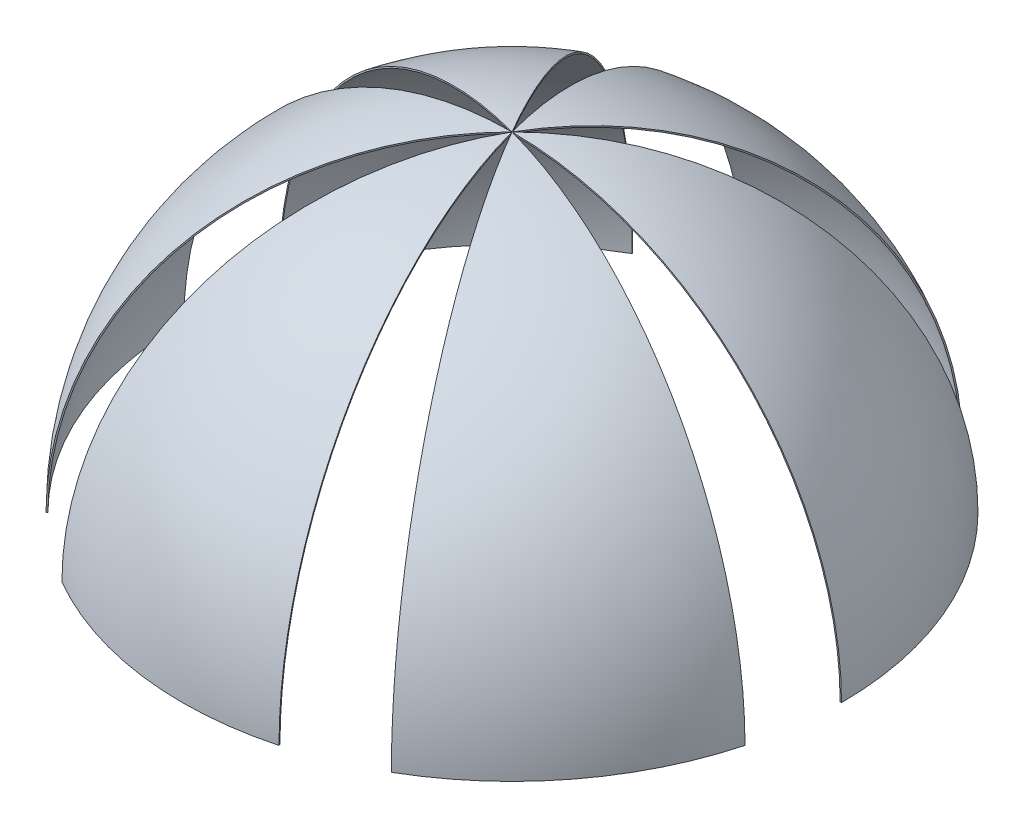
ISO-10303-21;
HEADER;
FILE_DESCRIPTION(('STEP AP214'),'2;1');
FILE_NAME('part.step','',(''),(''),'','','');
FILE_SCHEMA(('AUTOMOTIVE_DESIGN { 1 0 10303 214 1 1 1 1 }'));
ENDSEC;
DATA;
#1=APPLICATION_CONTEXT('core data for automotive mechanical design processes');
#2=APPLICATION_PROTOCOL_DEFINITION('international standard','automotive_design',2000,#1);
#3=PRODUCT_CONTEXT('',#1,'mechanical');
#4=PRODUCT('Part','Part','',(#3));
#5=PRODUCT_RELATED_PRODUCT_CATEGORY('part','',(#4));
#6=PRODUCT_DEFINITION_FORMATION('','',#4);
#7=PRODUCT_DEFINITION_CONTEXT('part definition',#1,'design');
#8=PRODUCT_DEFINITION('design','',#6,#7);
#9=PRODUCT_DEFINITION_SHAPE('','',#8);
#10=(LENGTH_UNIT() NAMED_UNIT(*) SI_UNIT(.MILLI.,.METRE.));
#11=(NAMED_UNIT(*) PLANE_ANGLE_UNIT() SI_UNIT($,.RADIAN.));
#12=(NAMED_UNIT(*) SI_UNIT($,.STERADIAN.) SOLID_ANGLE_UNIT());
#13=UNCERTAINTY_MEASURE_WITH_UNIT(LENGTH_MEASURE(1.E-05),#10,'distance_accuracy_value','');
#14=(GEOMETRIC_REPRESENTATION_CONTEXT(3) GLOBAL_UNCERTAINTY_ASSIGNED_CONTEXT((#13)) GLOBAL_UNIT_ASSIGNED_CONTEXT((#10,
#11,#12)) REPRESENTATION_CONTEXT('',''));
#15=CARTESIAN_POINT('',(0.,0.,0.));
#16=DIRECTION('',(0.,0.,1.));
#17=DIRECTION('',(1.,0.,0.));
#18=AXIS2_PLACEMENT_3D('',#15,#16,#17);
#19=CARTESIAN_POINT('',(0.,0.,0.));
#20=DIRECTION('',(0.,-1.,0.));
#21=DIRECTION('',(-0.258819045102511,0.,-0.965925826289071));
#22=AXIS2_PLACEMENT_3D('',#19,#20,#21);
#23=SPHERICAL_SURFACE('',#22,6140.45);
#24=CARTESIAN_POINT('',(0.,0.,0.));
#25=DIRECTION('',(-0.866025403784433,0.,-0.50000000000001));
#26=DIRECTION('',(-0.50000000000001,0.,0.866025403784433));
#27=AXIS2_PLACEMENT_3D('',#24,#25,#26);
#28=CIRCLE('',#27,6140.45);
#29=CARTESIAN_POINT('',(0.,6140.45,0.));
#30=VERTEX_POINT('',#29);
#31=CARTESIAN_POINT('',(3070.22500000006,0.,-5317.78569066812));
#32=VERTEX_POINT('',#31);
#33=EDGE_CURVE('E58',#30,#32,#28,.T.);
#34=ORIENTED_EDGE('',*,*,#33,.F.);
#35=CARTESIAN_POINT('',(0.,0.,0.));
#36=DIRECTION('',(-0.965925826289071,0.,0.258819045102511));
#37=DIRECTION('',(0.258819045102511,0.,0.965925826289071));
#38=AXIS2_PLACEMENT_3D('',#35,#36,#37);
#39=CIRCLE('',#38,6140.45);
#40=CARTESIAN_POINT('',(-1589.26540549971,0.,-5931.21924003672));
#41=VERTEX_POINT('',#40);
#42=EDGE_CURVE('E78',#30,#41,#39,.T.);
#43=ORIENTED_EDGE('',*,*,#42,.T.);
#44=CARTESIAN_POINT('',(0.,0.,0.));
#45=DIRECTION('',(0.,-1.,0.));
#46=DIRECTION('',(-0.866025403784433,0.,-0.50000000000001));
#47=AXIS2_PLACEMENT_3D('',#44,#45,#46);
#48=CIRCLE('',#47,6140.45);
#49=EDGE_CURVE('E51',#41,#32,#48,.T.);
#50=ORIENTED_EDGE('',*,*,#49,.T.);
#51=EDGE_LOOP('',(#34,#43,#50));
#52=FACE_BOUND('',#51,.T.);
#53=ADVANCED_FACE('F43',(#52),#23,.F.);
#54=CARTESIAN_POINT('',(0.,0.,0.));
#55=DIRECTION('',(0.,-1.,0.));
#56=DIRECTION('',(-0.258819045102511,0.,-0.965925826289071));
#57=AXIS2_PLACEMENT_3D('',#54,#55,#56);
#58=SPHERICAL_SURFACE('',#57,6165.85);
#59=CARTESIAN_POINT('',(0.,0.,0.));
#60=DIRECTION('',(0.,-1.,0.));
#61=DIRECTION('',(-0.866025403784433,0.,-0.50000000000001));
#62=AXIS2_PLACEMENT_3D('',#59,#60,#61);
#63=CIRCLE('',#62,6165.85);
#64=CARTESIAN_POINT('',(-1595.83940924532,0.,-5955.75375602447));
#65=VERTEX_POINT('',#64);
#66=CARTESIAN_POINT('',(3082.92500000006,0.,-5339.78273592424));
#67=VERTEX_POINT('',#66);
#68=EDGE_CURVE('E12',#65,#67,#63,.T.);
#69=ORIENTED_EDGE('',*,*,#68,.F.);
#70=CARTESIAN_POINT('',(0.,0.,0.));
#71=DIRECTION('',(0.965925826289071,0.,-0.258819045102511));
#72=DIRECTION('',(-0.258819045102511,0.,-0.965925826289071));
#73=AXIS2_PLACEMENT_3D('',#70,#71,#72);
#74=CIRCLE('',#73,6165.85);
#75=CARTESIAN_POINT('',(0.,6165.85,0.));
#76=VERTEX_POINT('',#75);
#77=EDGE_CURVE('E94',#65,#76,#74,.T.);
#78=ORIENTED_EDGE('',*,*,#77,.T.);
#79=CARTESIAN_POINT('',(0.,0.,0.));
#80=DIRECTION('',(0.866025403784433,0.,0.50000000000001));
#81=DIRECTION('',(0.50000000000001,0.,-0.866025403784433));
#82=AXIS2_PLACEMENT_3D('',#79,#80,#81);
#83=CIRCLE('',#82,6165.85);
#84=EDGE_CURVE('E65',#67,#76,#83,.T.);
#85=ORIENTED_EDGE('',*,*,#84,.F.);
#86=EDGE_LOOP('',(#69,#78,#85));
#87=FACE_BOUND('',#86,.T.);
#88=ADVANCED_FACE('F45',(#87),#58,.T.);
#89=CARTESIAN_POINT('',(-1589.26540549971,0.,-5931.21924003672));
#90=DIRECTION('',(0.,-1.,0.));
#91=DIRECTION('',(-0.866025403784433,0.,-0.50000000000001));
#92=AXIS2_PLACEMENT_3D('',#89,#90,#91);
#93=PLANE('',#92);
#94=DIRECTION('',(-0.258819045102511,0.,-0.965925826289071));
#95=VECTOR('',#94,1.);
#96=CARTESIAN_POINT('',(-1589.26540549971,0.,-5931.21924003672));
#97=LINE('',#96,#95);
#98=EDGE_CURVE('E92',#41,#65,#97,.T.);
#99=ORIENTED_EDGE('',*,*,#98,.T.);
#100=ORIENTED_EDGE('',*,*,#68,.T.);
#101=DIRECTION('',(0.50000000000001,0.,-0.866025403784433));
#102=VECTOR('',#101,1.);
#103=CARTESIAN_POINT('',(3070.22500000006,0.,-5317.78569066812));
#104=LINE('',#103,#102);
#105=EDGE_CURVE('E83',#32,#67,#104,.T.);
#106=ORIENTED_EDGE('',*,*,#105,.F.);
#107=ORIENTED_EDGE('',*,*,#49,.F.);
#108=EDGE_LOOP('',(#99,#100,#106,#107));
#109=FACE_BOUND('',#108,.T.);
#110=ADVANCED_FACE('F84',(#109),#93,.T.);
#111=CARTESIAN_POINT('',(0.,0.,0.));
#112=DIRECTION('',(-0.965925826289071,0.,0.258819045102511));
#113=DIRECTION('',(0.258819045102511,0.,0.965925826289071));
#114=AXIS2_PLACEMENT_3D('',#111,#112,#113);
#115=PLANE('',#114);
#116=ORIENTED_EDGE('',*,*,#42,.F.);
#117=DIRECTION('',(0.,-1.,0.));
#118=VECTOR('',#117,1.);
#119=CARTESIAN_POINT('',(0.,6140.45,0.));
#120=LINE('',#119,#118);
#121=EDGE_CURVE('E82',#76,#30,#120,.T.);
#122=ORIENTED_EDGE('',*,*,#121,.F.);
#123=ORIENTED_EDGE('',*,*,#77,.F.);
#124=ORIENTED_EDGE('',*,*,#98,.F.);
#125=EDGE_LOOP('',(#116,#122,#123,#124));
#126=FACE_BOUND('',#125,.T.);
#127=ADVANCED_FACE('F99',(#126),#115,.T.);
#128=CARTESIAN_POINT('',(0.,0.,0.));
#129=DIRECTION('',(-0.866025403784433,0.,-0.50000000000001));
#130=DIRECTION('',(-0.50000000000001,0.,0.866025403784433));
#131=AXIS2_PLACEMENT_3D('',#128,#129,#130);
#132=PLANE('',#131);
#133=ORIENTED_EDGE('',*,*,#33,.T.);
#134=ORIENTED_EDGE('',*,*,#105,.T.);
#135=ORIENTED_EDGE('',*,*,#84,.T.);
#136=ORIENTED_EDGE('',*,*,#121,.T.);
#137=EDGE_LOOP('',(#133,#134,#135,#136));
#138=FACE_BOUND('',#137,.T.);
#139=ADVANCED_FACE('F86',(#138),#132,.F.);
#140=CLOSED_SHELL('',(#53,#88,#110,#127,#139));
#141=MANIFOLD_SOLID_BREP('B2',#140);
#142=CARTESIAN_POINT('',(0.,0.,0.));
#143=DIRECTION('',(0.,-1.,0.));
#144=DIRECTION('',(-0.965925826289066,0.,-0.258819045102528));
#145=AXIS2_PLACEMENT_3D('',#142,#143,#144);
#146=SPHERICAL_SURFACE('',#145,6140.45);
#147=CARTESIAN_POINT('',(0.,0.,0.));
#148=DIRECTION('',(-0.866025403784443,0.,0.499999999999992));
#149=DIRECTION('',(0.499999999999992,0.,0.866025403784443));
#150=AXIS2_PLACEMENT_3D('',#147,#148,#149);
#151=CIRCLE('',#150,6140.45);
#152=CARTESIAN_POINT('',(0.,6140.45,0.));
#153=VERTEX_POINT('',#152);
#154=CARTESIAN_POINT('',(-3070.22499999995,0.,-5317.78569066818));
#155=VERTEX_POINT('',#154);
#156=EDGE_CURVE('E165',#153,#155,#151,.T.);
#157=ORIENTED_EDGE('',*,*,#156,.F.);
#158=CARTESIAN_POINT('',(0.,0.,0.));
#159=DIRECTION('',(-0.258819045102528,0.,0.965925826289066));
#160=DIRECTION('',(0.965925826289066,0.,0.258819045102528));
#161=AXIS2_PLACEMENT_3D('',#158,#159,#160);
#162=CIRCLE('',#161,6140.45);
#163=CARTESIAN_POINT('',(-5931.2192400367,0.,-1589.26540549982));
#164=VERTEX_POINT('',#163);
#165=EDGE_CURVE('E185',#153,#164,#162,.T.);
#166=ORIENTED_EDGE('',*,*,#165,.T.);
#167=CARTESIAN_POINT('',(0.,0.,0.));
#168=DIRECTION('',(0.,-1.,0.));
#169=DIRECTION('',(-0.866025403784443,0.,0.499999999999992));
#170=AXIS2_PLACEMENT_3D('',#167,#168,#169);
#171=CIRCLE('',#170,6140.45);
#172=EDGE_CURVE('E158',#164,#155,#171,.T.);
#173=ORIENTED_EDGE('',*,*,#172,.T.);
#174=EDGE_LOOP('',(#157,#166,#173));
#175=FACE_BOUND('',#174,.T.);
#176=ADVANCED_FACE('F150',(#175),#146,.F.);
#177=CARTESIAN_POINT('',(0.,0.,0.));
#178=DIRECTION('',(0.,-1.,0.));
#179=DIRECTION('',(-0.965925826289066,0.,-0.258819045102528));
#180=AXIS2_PLACEMENT_3D('',#177,#178,#179);
#181=SPHERICAL_SURFACE('',#180,6165.85);
#182=CARTESIAN_POINT('',(0.,0.,0.));
#183=DIRECTION('',(0.,-1.,0.));
#184=DIRECTION('',(-0.866025403784443,0.,0.499999999999992));
#185=AXIS2_PLACEMENT_3D('',#182,#183,#184);
#186=CIRCLE('',#185,6165.85);
#187=CARTESIAN_POINT('',(-5955.75375602444,0.,-1595.83940924542));
#188=VERTEX_POINT('',#187);
#189=CARTESIAN_POINT('',(-3082.92499999995,0.,-5339.78273592431));
#190=VERTEX_POINT('',#189);
#191=EDGE_CURVE('E41',#188,#190,#186,.T.);
#192=ORIENTED_EDGE('',*,*,#191,.F.);
#193=CARTESIAN_POINT('',(0.,0.,0.));
#194=DIRECTION('',(0.258819045102528,0.,-0.965925826289066));
#195=DIRECTION('',(-0.965925826289066,0.,-0.258819045102528));
#196=AXIS2_PLACEMENT_3D('',#193,#194,#195);
#197=CIRCLE('',#196,6165.85);
#198=CARTESIAN_POINT('',(0.,6165.85,0.));
#199=VERTEX_POINT('',#198);
#200=EDGE_CURVE('E201',#188,#199,#197,.T.);
#201=ORIENTED_EDGE('',*,*,#200,.T.);
#202=CARTESIAN_POINT('',(0.,0.,0.));
#203=DIRECTION('',(0.866025403784443,0.,-0.499999999999992));
#204=DIRECTION('',(-0.499999999999992,0.,-0.866025403784443));
#205=AXIS2_PLACEMENT_3D('',#202,#203,#204);
#206=CIRCLE('',#205,6165.85);
#207=EDGE_CURVE('E172',#190,#199,#206,.T.);
#208=ORIENTED_EDGE('',*,*,#207,.F.);
#209=EDGE_LOOP('',(#192,#201,#208));
#210=FACE_BOUND('',#209,.T.);
#211=ADVANCED_FACE('F152',(#210),#181,.T.);
#212=CARTESIAN_POINT('',(-5931.2192400367,0.,-1589.26540549982));
#213=DIRECTION('',(0.,-1.,0.));
#214=DIRECTION('',(-0.866025403784443,0.,0.499999999999992));
#215=AXIS2_PLACEMENT_3D('',#212,#213,#214);
#216=PLANE('',#215);
#217=DIRECTION('',(-0.965925826289066,0.,-0.258819045102528));
#218=VECTOR('',#217,1.);
#219=CARTESIAN_POINT('',(-5931.2192400367,0.,-1589.26540549982));
#220=LINE('',#219,#218);
#221=EDGE_CURVE('E199',#164,#188,#220,.T.);
#222=ORIENTED_EDGE('',*,*,#221,.T.);
#223=ORIENTED_EDGE('',*,*,#191,.T.);
#224=DIRECTION('',(-0.499999999999992,0.,-0.866025403784443));
#225=VECTOR('',#224,1.);
#226=CARTESIAN_POINT('',(-3070.22499999995,0.,-5317.78569066818));
#227=LINE('',#226,#225);
#228=EDGE_CURVE('E190',#155,#190,#227,.T.);
#229=ORIENTED_EDGE('',*,*,#228,.F.);
#230=ORIENTED_EDGE('',*,*,#172,.F.);
#231=EDGE_LOOP('',(#222,#223,#229,#230));
#232=FACE_BOUND('',#231,.T.);
#233=ADVANCED_FACE('F191',(#232),#216,.T.);
#234=CARTESIAN_POINT('',(0.,0.,0.));
#235=DIRECTION('',(-0.258819045102528,0.,0.965925826289066));
#236=DIRECTION('',(0.965925826289066,0.,0.258819045102528));
#237=AXIS2_PLACEMENT_3D('',#234,#235,#236);
#238=PLANE('',#237);
#239=ORIENTED_EDGE('',*,*,#165,.F.);
#240=DIRECTION('',(0.,-1.,0.));
#241=VECTOR('',#240,1.);
#242=CARTESIAN_POINT('',(0.,6140.45,0.));
#243=LINE('',#242,#241);
#244=EDGE_CURVE('E189',#199,#153,#243,.T.);
#245=ORIENTED_EDGE('',*,*,#244,.F.);
#246=ORIENTED_EDGE('',*,*,#200,.F.);
#247=ORIENTED_EDGE('',*,*,#221,.F.);
#248=EDGE_LOOP('',(#239,#245,#246,#247));
#249=FACE_BOUND('',#248,.T.);
#250=ADVANCED_FACE('F206',(#249),#238,.T.);
#251=CARTESIAN_POINT('',(0.,0.,0.));
#252=DIRECTION('',(-0.866025403784443,0.,0.499999999999992));
#253=DIRECTION('',(0.499999999999992,0.,0.866025403784443));
#254=AXIS2_PLACEMENT_3D('',#251,#252,#253);
#255=PLANE('',#254);
#256=ORIENTED_EDGE('',*,*,#156,.T.);
#257=ORIENTED_EDGE('',*,*,#228,.T.);
#258=ORIENTED_EDGE('',*,*,#207,.T.);
#259=ORIENTED_EDGE('',*,*,#244,.T.);
#260=EDGE_LOOP('',(#256,#257,#258,#259));
#261=FACE_BOUND('',#260,.T.);
#262=ADVANCED_FACE('F193',(#261),#255,.F.);
#263=CLOSED_SHELL('',(#176,#211,#233,#250,#262));
#264=MANIFOLD_SOLID_BREP('B6',#263);
#265=CARTESIAN_POINT('',(0.,0.,0.));
#266=DIRECTION('',(0.,-1.,0.));
#267=DIRECTION('',(-0.707106781186546,0.,0.707106781186549));
#268=AXIS2_PLACEMENT_3D('',#265,#266,#267);
#269=SPHERICAL_SURFACE('',#268,6140.45);
#270=CARTESIAN_POINT('',(0.,0.,0.));
#271=DIRECTION('',(0.,0.,1.));
#272=DIRECTION('',(1.,0.,0.));
#273=AXIS2_PLACEMENT_3D('',#270,#271,#272);
#274=CIRCLE('',#273,6140.45);
#275=CARTESIAN_POINT('',(0.,6140.45,0.));
#276=VERTEX_POINT('',#275);
#277=CARTESIAN_POINT('',(-6140.45,0.,0.));
#278=VERTEX_POINT('',#277);
#279=EDGE_CURVE('E272',#276,#278,#274,.T.);
#280=ORIENTED_EDGE('',*,*,#279,.F.);
#281=CARTESIAN_POINT('',(0.,0.,0.));
#282=DIRECTION('',(0.707106781186549,0.,0.707106781186546));
#283=DIRECTION('',(0.707106781186546,0.,-0.707106781186549));
#284=AXIS2_PLACEMENT_3D('',#281,#282,#283);
#285=CIRCLE('',#284,6140.45);
#286=CARTESIAN_POINT('',(-4341.95383453693,0.,4341.95383453694));
#287=VERTEX_POINT('',#286);
#288=EDGE_CURVE('E292',#276,#287,#285,.T.);
#289=ORIENTED_EDGE('',*,*,#288,.T.);
#290=CARTESIAN_POINT('',(0.,0.,0.));
#291=DIRECTION('',(0.,-1.,0.));
#292=DIRECTION('',(0.,0.,1.));
#293=AXIS2_PLACEMENT_3D('',#290,#291,#292);
#294=CIRCLE('',#293,6140.45);
#295=EDGE_CURVE('E265',#287,#278,#294,.T.);
#296=ORIENTED_EDGE('',*,*,#295,.T.);
#297=EDGE_LOOP('',(#280,#289,#296));
#298=FACE_BOUND('',#297,.T.);
#299=ADVANCED_FACE('F257',(#298),#269,.F.);
#300=CARTESIAN_POINT('',(0.,0.,0.));
#301=DIRECTION('',(0.,-1.,0.));
#302=DIRECTION('',(-0.707106781186546,0.,0.707106781186549));
#303=AXIS2_PLACEMENT_3D('',#300,#301,#302);
#304=SPHERICAL_SURFACE('',#303,6165.85);
#305=CARTESIAN_POINT('',(0.,0.,0.));
#306=DIRECTION('',(0.,-1.,0.));
#307=DIRECTION('',(0.,0.,1.));
#308=AXIS2_PLACEMENT_3D('',#305,#306,#307);
#309=CIRCLE('',#308,6165.85);
#310=CARTESIAN_POINT('',(-4359.91434677907,0.,4359.91434677908));
#311=VERTEX_POINT('',#310);
#312=CARTESIAN_POINT('',(-6165.85,0.,0.));
#313=VERTEX_POINT('',#312);
#314=EDGE_CURVE('E148',#311,#313,#309,.T.);
#315=ORIENTED_EDGE('',*,*,#314,.F.);
#316=CARTESIAN_POINT('',(0.,0.,0.));
#317=DIRECTION('',(-0.707106781186549,0.,-0.707106781186546));
#318=DIRECTION('',(-0.707106781186546,0.,0.707106781186549));
#319=AXIS2_PLACEMENT_3D('',#316,#317,#318);
#320=CIRCLE('',#319,6165.85);
#321=CARTESIAN_POINT('',(0.,6165.85,0.));
#322=VERTEX_POINT('',#321);
#323=EDGE_CURVE('E308',#311,#322,#320,.T.);
#324=ORIENTED_EDGE('',*,*,#323,.T.);
#325=CARTESIAN_POINT('',(0.,0.,0.));
#326=DIRECTION('',(0.,0.,-1.));
#327=DIRECTION('',(-1.,0.,0.));
#328=AXIS2_PLACEMENT_3D('',#325,#326,#327);
#329=CIRCLE('',#328,6165.85);
#330=EDGE_CURVE('E279',#313,#322,#329,.T.);
#331=ORIENTED_EDGE('',*,*,#330,.F.);
#332=EDGE_LOOP('',(#315,#324,#331));
#333=FACE_BOUND('',#332,.T.);
#334=ADVANCED_FACE('F259',(#333),#304,.T.);
#335=CARTESIAN_POINT('',(-4341.95383453693,0.,4341.95383453694));
#336=DIRECTION('',(0.,-1.,0.));
#337=DIRECTION('',(0.,0.,1.));
#338=AXIS2_PLACEMENT_3D('',#335,#336,#337);
#339=PLANE('',#338);
#340=DIRECTION('',(-0.707106781186546,0.,0.707106781186549));
#341=VECTOR('',#340,1.);
#342=CARTESIAN_POINT('',(-4341.95383453693,0.,4341.95383453694));
#343=LINE('',#342,#341);
#344=EDGE_CURVE('E306',#287,#311,#343,.T.);
#345=ORIENTED_EDGE('',*,*,#344,.T.);
#346=ORIENTED_EDGE('',*,*,#314,.T.);
#347=DIRECTION('',(-1.,0.,0.));
#348=VECTOR('',#347,1.);
#349=CARTESIAN_POINT('',(-6140.45,0.,0.));
#350=LINE('',#349,#348);
#351=EDGE_CURVE('E297',#278,#313,#350,.T.);
#352=ORIENTED_EDGE('',*,*,#351,.F.);
#353=ORIENTED_EDGE('',*,*,#295,.F.);
#354=EDGE_LOOP('',(#345,#346,#352,#353));
#355=FACE_BOUND('',#354,.T.);
#356=ADVANCED_FACE('F298',(#355),#339,.T.);
#357=CARTESIAN_POINT('',(0.,0.,0.));
#358=DIRECTION('',(0.707106781186549,0.,0.707106781186546));
#359=DIRECTION('',(0.707106781186546,0.,-0.707106781186549));
#360=AXIS2_PLACEMENT_3D('',#357,#358,#359);
#361=PLANE('',#360);
#362=ORIENTED_EDGE('',*,*,#288,.F.);
#363=DIRECTION('',(0.,-1.,0.));
#364=VECTOR('',#363,1.);
#365=CARTESIAN_POINT('',(0.,6140.45,0.));
#366=LINE('',#365,#364);
#367=EDGE_CURVE('E296',#322,#276,#366,.T.);
#368=ORIENTED_EDGE('',*,*,#367,.F.);
#369=ORIENTED_EDGE('',*,*,#323,.F.);
#370=ORIENTED_EDGE('',*,*,#344,.F.);
#371=EDGE_LOOP('',(#362,#368,#369,#370));
#372=FACE_BOUND('',#371,.T.);
#373=ADVANCED_FACE('F313',(#372),#361,.T.);
#374=CARTESIAN_POINT('',(0.,0.,0.));
#375=DIRECTION('',(0.,0.,1.));
#376=DIRECTION('',(1.,0.,0.));
#377=AXIS2_PLACEMENT_3D('',#374,#375,#376);
#378=PLANE('',#377);
#379=ORIENTED_EDGE('',*,*,#279,.T.);
#380=ORIENTED_EDGE('',*,*,#351,.T.);
#381=ORIENTED_EDGE('',*,*,#330,.T.);
#382=ORIENTED_EDGE('',*,*,#367,.T.);
#383=EDGE_LOOP('',(#379,#380,#381,#382));
#384=FACE_BOUND('',#383,.T.);
#385=ADVANCED_FACE('F300',(#384),#378,.F.);
#386=CLOSED_SHELL('',(#299,#334,#356,#373,#385));
#387=MANIFOLD_SOLID_BREP('B35',#386);
#388=CARTESIAN_POINT('',(0.,0.,0.));
#389=DIRECTION('',(0.,-1.,0.));
#390=DIRECTION('',(0.258819045102518,0.,0.965925826289069));
#391=AXIS2_PLACEMENT_3D('',#388,#389,#390);
#392=SPHERICAL_SURFACE('',#391,6140.45);
#393=CARTESIAN_POINT('',(0.,0.,0.));
#394=DIRECTION('',(0.866025403784436,0.,0.500000000000004));
#395=DIRECTION('',(0.500000000000004,0.,-0.866025403784436));
#396=AXIS2_PLACEMENT_3D('',#393,#394,#395);
#397=CIRCLE('',#396,6140.45);
#398=CARTESIAN_POINT('',(0.,6140.45,0.));
#399=VERTEX_POINT('',#398);
#400=CARTESIAN_POINT('',(-3070.22500000002,0.,5317.78569066814));
#401=VERTEX_POINT('',#400);
#402=EDGE_CURVE('E379',#399,#401,#397,.T.);
#403=ORIENTED_EDGE('',*,*,#402,.F.);
#404=CARTESIAN_POINT('',(0.,0.,0.));
#405=DIRECTION('',(0.965925826289069,0.,-0.258819045102518));
#406=DIRECTION('',(-0.258819045102518,0.,-0.965925826289069));
#407=AXIS2_PLACEMENT_3D('',#404,#405,#406);
#408=CIRCLE('',#407,6140.45);
#409=CARTESIAN_POINT('',(1589.26540549976,0.,5931.21924003671));
#410=VERTEX_POINT('',#409);
#411=EDGE_CURVE('E399',#399,#410,#408,.T.);
#412=ORIENTED_EDGE('',*,*,#411,.T.);
#413=CARTESIAN_POINT('',(0.,0.,0.));
#414=DIRECTION('',(0.,-1.,0.));
#415=DIRECTION('',(0.866025403784436,0.,0.500000000000004));
#416=AXIS2_PLACEMENT_3D('',#413,#414,#415);
#417=CIRCLE('',#416,6140.45);
#418=EDGE_CURVE('E372',#410,#401,#417,.T.);
#419=ORIENTED_EDGE('',*,*,#418,.T.);
#420=EDGE_LOOP('',(#403,#412,#419));
#421=FACE_BOUND('',#420,.T.);
#422=ADVANCED_FACE('F364',(#421),#392,.F.);
#423=CARTESIAN_POINT('',(0.,0.,0.));
#424=DIRECTION('',(0.,-1.,0.));
#425=DIRECTION('',(0.258819045102518,0.,0.965925826289069));
#426=AXIS2_PLACEMENT_3D('',#423,#424,#425);
#427=SPHERICAL_SURFACE('',#426,6165.85);
#428=CARTESIAN_POINT('',(0.,0.,0.));
#429=DIRECTION('',(0.,-1.,0.));
#430=DIRECTION('',(0.866025403784436,0.,0.500000000000004));
#431=AXIS2_PLACEMENT_3D('',#428,#429,#430);
#432=CIRCLE('',#431,6165.85);
#433=CARTESIAN_POINT('',(1595.83940924536,0.,5955.75375602446));
#434=VERTEX_POINT('',#433);
#435=CARTESIAN_POINT('',(-3082.92500000002,0.,5339.78273592427));
#436=VERTEX_POINT('',#435);
#437=EDGE_CURVE('E255',#434,#436,#432,.T.);
#438=ORIENTED_EDGE('',*,*,#437,.F.);
#439=CARTESIAN_POINT('',(0.,0.,0.));
#440=DIRECTION('',(-0.965925826289069,0.,0.258819045102518));
#441=DIRECTION('',(0.258819045102518,0.,0.965925826289069));
#442=AXIS2_PLACEMENT_3D('',#439,#440,#441);
#443=CIRCLE('',#442,6165.85);
#444=CARTESIAN_POINT('',(0.,6165.85,0.));
#445=VERTEX_POINT('',#444);
#446=EDGE_CURVE('E415',#434,#445,#443,.T.);
#447=ORIENTED_EDGE('',*,*,#446,.T.);
#448=CARTESIAN_POINT('',(0.,0.,0.));
#449=DIRECTION('',(-0.866025403784436,0.,-0.500000000000004));
#450=DIRECTION('',(-0.500000000000004,0.,0.866025403784436));
#451=AXIS2_PLACEMENT_3D('',#448,#449,#450);
#452=CIRCLE('',#451,6165.85);
#453=EDGE_CURVE('E386',#436,#445,#452,.T.);
#454=ORIENTED_EDGE('',*,*,#453,.F.);
#455=EDGE_LOOP('',(#438,#447,#454));
#456=FACE_BOUND('',#455,.T.);
#457=ADVANCED_FACE('F366',(#456),#427,.T.);
#458=CARTESIAN_POINT('',(1589.26540549976,0.,5931.21924003671));
#459=DIRECTION('',(0.,-1.,0.));
#460=DIRECTION('',(0.866025403784436,0.,0.500000000000004));
#461=AXIS2_PLACEMENT_3D('',#458,#459,#460);
#462=PLANE('',#461);
#463=DIRECTION('',(0.258819045102518,0.,0.965925826289069));
#464=VECTOR('',#463,1.);
#465=CARTESIAN_POINT('',(1589.26540549976,0.,5931.21924003671));
#466=LINE('',#465,#464);
#467=EDGE_CURVE('E413',#410,#434,#466,.T.);
#468=ORIENTED_EDGE('',*,*,#467,.T.);
#469=ORIENTED_EDGE('',*,*,#437,.T.);
#470=DIRECTION('',(-0.500000000000004,0.,0.866025403784436));
#471=VECTOR('',#470,1.);
#472=CARTESIAN_POINT('',(-3070.22500000002,0.,5317.78569066814));
#473=LINE('',#472,#471);
#474=EDGE_CURVE('E404',#401,#436,#473,.T.);
#475=ORIENTED_EDGE('',*,*,#474,.F.);
#476=ORIENTED_EDGE('',*,*,#418,.F.);
#477=EDGE_LOOP('',(#468,#469,#475,#476));
#478=FACE_BOUND('',#477,.T.);
#479=ADVANCED_FACE('F405',(#478),#462,.T.);
#480=CARTESIAN_POINT('',(0.,0.,0.));
#481=DIRECTION('',(0.965925826289069,0.,-0.258819045102518));
#482=DIRECTION('',(-0.258819045102518,0.,-0.965925826289069));
#483=AXIS2_PLACEMENT_3D('',#480,#481,#482);
#484=PLANE('',#483);
#485=ORIENTED_EDGE('',*,*,#411,.F.);
#486=DIRECTION('',(0.,-1.,0.));
#487=VECTOR('',#486,1.);
#488=CARTESIAN_POINT('',(0.,6140.45,0.));
#489=LINE('',#488,#487);
#490=EDGE_CURVE('E403',#445,#399,#489,.T.);
#491=ORIENTED_EDGE('',*,*,#490,.F.);
#492=ORIENTED_EDGE('',*,*,#446,.F.);
#493=ORIENTED_EDGE('',*,*,#467,.F.);
#494=EDGE_LOOP('',(#485,#491,#492,#493));
#495=FACE_BOUND('',#494,.T.);
#496=ADVANCED_FACE('F420',(#495),#484,.T.);
#497=CARTESIAN_POINT('',(0.,0.,0.));
#498=DIRECTION('',(0.866025403784436,0.,0.500000000000004));
#499=DIRECTION('',(0.500000000000004,0.,-0.866025403784436));
#500=AXIS2_PLACEMENT_3D('',#497,#498,#499);
#501=PLANE('',#500);
#502=ORIENTED_EDGE('',*,*,#402,.T.);
#503=ORIENTED_EDGE('',*,*,#474,.T.);
#504=ORIENTED_EDGE('',*,*,#453,.T.);
#505=ORIENTED_EDGE('',*,*,#490,.T.);
#506=EDGE_LOOP('',(#502,#503,#504,#505));
#507=FACE_BOUND('',#506,.T.);
#508=ADVANCED_FACE('F407',(#507),#501,.F.);
#509=CLOSED_SHELL('',(#422,#457,#479,#496,#508));
#510=MANIFOLD_SOLID_BREP('B142',#509);
#511=CARTESIAN_POINT('',(0.,0.,0.));
#512=DIRECTION('',(0.,-1.,0.));
#513=DIRECTION('',(0.965925826289068,0.,0.258819045102521));
#514=AXIS2_PLACEMENT_3D('',#511,#512,#513);
#515=SPHERICAL_SURFACE('',#514,6140.45);
#516=CARTESIAN_POINT('',(0.,0.,0.));
#517=DIRECTION('',(0.86602540378444,0.,-0.499999999999998));
#518=DIRECTION('',(-0.499999999999998,0.,-0.86602540378444));
#519=AXIS2_PLACEMENT_3D('',#516,#517,#518);
#520=CIRCLE('',#519,6140.45);
#521=CARTESIAN_POINT('',(0.,6140.45,0.));
#522=VERTEX_POINT('',#521);
#523=CARTESIAN_POINT('',(3070.22499999999,0.,5317.78569066816));
#524=VERTEX_POINT('',#523);
#525=EDGE_CURVE('E485',#522,#524,#520,.T.);
#526=ORIENTED_EDGE('',*,*,#525,.F.);
#527=CARTESIAN_POINT('',(0.,0.,0.));
#528=DIRECTION('',(0.258819045102521,0.,-0.965925826289068));
#529=DIRECTION('',(-0.965925826289068,0.,-0.258819045102521));
#530=AXIS2_PLACEMENT_3D('',#527,#528,#529);
#531=CIRCLE('',#530,6140.45);
#532=CARTESIAN_POINT('',(5931.21924003671,0.,1589.26540549978));
#533=VERTEX_POINT('',#532);
#534=EDGE_CURVE('E505',#522,#533,#531,.T.);
#535=ORIENTED_EDGE('',*,*,#534,.T.);
#536=CARTESIAN_POINT('',(0.,0.,0.));
#537=DIRECTION('',(0.,-1.,0.));
#538=DIRECTION('',(0.86602540378444,0.,-0.499999999999998));
#539=AXIS2_PLACEMENT_3D('',#536,#537,#538);
#540=CIRCLE('',#539,6140.45);
#541=EDGE_CURVE('E478',#533,#524,#540,.T.);
#542=ORIENTED_EDGE('',*,*,#541,.T.);
#543=EDGE_LOOP('',(#526,#535,#542));
#544=FACE_BOUND('',#543,.T.);
#545=ADVANCED_FACE('F470',(#544),#515,.F.);
#546=CARTESIAN_POINT('',(0.,0.,0.));
#547=DIRECTION('',(0.,-1.,0.));
#548=DIRECTION('',(0.965925826289068,0.,0.258819045102521));
#549=AXIS2_PLACEMENT_3D('',#546,#547,#548);
#550=SPHERICAL_SURFACE('',#549,6165.85);
#551=CARTESIAN_POINT('',(0.,0.,0.));
#552=DIRECTION('',(0.,-1.,0.));
#553=DIRECTION('',(0.86602540378444,0.,-0.499999999999998));
#554=AXIS2_PLACEMENT_3D('',#551,#552,#553);
#555=CIRCLE('',#554,6165.85);
#556=CARTESIAN_POINT('',(5955.75375602445,0.,1595.83940924538));
#557=VERTEX_POINT('',#556);
#558=CARTESIAN_POINT('',(3082.92499999999,0.,5339.78273592429));
#559=VERTEX_POINT('',#558);
#560=EDGE_CURVE('E362',#557,#559,#555,.T.);
#561=ORIENTED_EDGE('',*,*,#560,.F.);
#562=CARTESIAN_POINT('',(0.,0.,0.));
#563=DIRECTION('',(-0.258819045102521,0.,0.965925826289068));
#564=DIRECTION('',(0.965925826289068,0.,0.258819045102521));
#565=AXIS2_PLACEMENT_3D('',#562,#563,#564);
#566=CIRCLE('',#565,6165.85);
#567=CARTESIAN_POINT('',(0.,6165.85,0.));
#568=VERTEX_POINT('',#567);
#569=EDGE_CURVE('E521',#557,#568,#566,.T.);
#570=ORIENTED_EDGE('',*,*,#569,.T.);
#571=CARTESIAN_POINT('',(0.,0.,0.));
#572=DIRECTION('',(-0.86602540378444,0.,0.499999999999998));
#573=DIRECTION('',(0.499999999999998,0.,0.86602540378444));
#574=AXIS2_PLACEMENT_3D('',#571,#572,#573);
#575=CIRCLE('',#574,6165.85);
#576=EDGE_CURVE('E492',#559,#568,#575,.T.);
#577=ORIENTED_EDGE('',*,*,#576,.F.);
#578=EDGE_LOOP('',(#561,#570,#577));
#579=FACE_BOUND('',#578,.T.);
#580=ADVANCED_FACE('F472',(#579),#550,.T.);
#581=CARTESIAN_POINT('',(5931.21924003671,0.,1589.26540549978));
#582=DIRECTION('',(0.,-1.,0.));
#583=DIRECTION('',(0.86602540378444,0.,-0.499999999999998));
#584=AXIS2_PLACEMENT_3D('',#581,#582,#583);
#585=PLANE('',#584);
#586=DIRECTION('',(0.965925826289068,0.,0.258819045102521));
#587=VECTOR('',#586,1.);
#588=CARTESIAN_POINT('',(5931.21924003671,0.,1589.26540549978));
#589=LINE('',#588,#587);
#590=EDGE_CURVE('E519',#533,#557,#589,.T.);
#591=ORIENTED_EDGE('',*,*,#590,.T.);
#592=ORIENTED_EDGE('',*,*,#560,.T.);
#593=DIRECTION('',(0.499999999999998,0.,0.86602540378444));
#594=VECTOR('',#593,1.);
#595=CARTESIAN_POINT('',(3070.22499999999,0.,5317.78569066816));
#596=LINE('',#595,#594);
#597=EDGE_CURVE('E510',#524,#559,#596,.T.);
#598=ORIENTED_EDGE('',*,*,#597,.F.);
#599=ORIENTED_EDGE('',*,*,#541,.F.);
#600=EDGE_LOOP('',(#591,#592,#598,#599));
#601=FACE_BOUND('',#600,.T.);
#602=ADVANCED_FACE('F511',(#601),#585,.T.);
#603=CARTESIAN_POINT('',(0.,0.,0.));
#604=DIRECTION('',(0.258819045102521,0.,-0.965925826289068));
#605=DIRECTION('',(-0.965925826289068,0.,-0.258819045102521));
#606=AXIS2_PLACEMENT_3D('',#603,#604,#605);
#607=PLANE('',#606);
#608=ORIENTED_EDGE('',*,*,#534,.F.);
#609=DIRECTION('',(0.,-1.,0.));
#610=VECTOR('',#609,1.);
#611=CARTESIAN_POINT('',(0.,6140.45,0.));
#612=LINE('',#611,#610);
#613=EDGE_CURVE('E509',#568,#522,#612,.T.);
#614=ORIENTED_EDGE('',*,*,#613,.F.);
#615=ORIENTED_EDGE('',*,*,#569,.F.);
#616=ORIENTED_EDGE('',*,*,#590,.F.);
#617=EDGE_LOOP('',(#608,#614,#615,#616));
#618=FACE_BOUND('',#617,.T.);
#619=ADVANCED_FACE('F526',(#618),#607,.T.);
#620=CARTESIAN_POINT('',(0.,0.,0.));
#621=DIRECTION('',(0.86602540378444,0.,-0.499999999999998));
#622=DIRECTION('',(-0.499999999999998,0.,-0.86602540378444));
#623=AXIS2_PLACEMENT_3D('',#620,#621,#622);
#624=PLANE('',#623);
#625=ORIENTED_EDGE('',*,*,#525,.T.);
#626=ORIENTED_EDGE('',*,*,#597,.T.);
#627=ORIENTED_EDGE('',*,*,#576,.T.);
#628=ORIENTED_EDGE('',*,*,#613,.T.);
#629=EDGE_LOOP('',(#625,#626,#627,#628));
#630=FACE_BOUND('',#629,.T.);
#631=ADVANCED_FACE('F513',(#630),#624,.F.);
#632=CLOSED_SHELL('',(#545,#580,#602,#619,#631));
#633=MANIFOLD_SOLID_BREP('B249',#632);
#634=CARTESIAN_POINT('',(0.,0.,0.));
#635=DIRECTION('',(0.,-1.,0.));
#636=DIRECTION('',(0.707106781186546,0.,-0.707106781186549));
#637=AXIS2_PLACEMENT_3D('',#634,#635,#636);
#638=SPHERICAL_SURFACE('',#637,6140.45);
#639=CARTESIAN_POINT('',(0.,0.,0.));
#640=DIRECTION('',(0.,0.,-1.));
#641=DIRECTION('',(-1.,0.,0.));
#642=AXIS2_PLACEMENT_3D('',#639,#640,#641);
#643=CIRCLE('',#642,6140.45);
#644=CARTESIAN_POINT('',(0.,6140.45,0.));
#645=VERTEX_POINT('',#644);
#646=CARTESIAN_POINT('',(6140.45,0.,0.));
#647=VERTEX_POINT('',#646);
#648=EDGE_CURVE('E582',#645,#647,#643,.T.);
#649=ORIENTED_EDGE('',*,*,#648,.F.);
#650=CARTESIAN_POINT('',(0.,0.,0.));
#651=DIRECTION('',(-0.707106781186549,0.,-0.707106781186546));
#652=DIRECTION('',(-0.707106781186546,0.,0.707106781186549));
#653=AXIS2_PLACEMENT_3D('',#650,#651,#652);
#654=CIRCLE('',#653,6140.45);
#655=CARTESIAN_POINT('',(4341.95383453693,0.,-4341.95383453694));
#656=VERTEX_POINT('',#655);
#657=EDGE_CURVE('E602',#645,#656,#654,.T.);
#658=ORIENTED_EDGE('',*,*,#657,.T.);
#659=CARTESIAN_POINT('',(0.,0.,0.));
#660=DIRECTION('',(0.,-1.,0.));
#661=DIRECTION('',(0.,0.,-1.));
#662=AXIS2_PLACEMENT_3D('',#659,#660,#661);
#663=CIRCLE('',#662,6140.45);
#664=EDGE_CURVE('E575',#656,#647,#663,.T.);
#665=ORIENTED_EDGE('',*,*,#664,.T.);
#666=EDGE_LOOP('',(#649,#658,#665));
#667=FACE_BOUND('',#666,.T.);
#668=ADVANCED_FACE('F567',(#667),#638,.F.);
#669=CARTESIAN_POINT('',(0.,0.,0.));
#670=DIRECTION('',(0.,-1.,0.));
#671=DIRECTION('',(0.707106781186546,0.,-0.707106781186549));
#672=AXIS2_PLACEMENT_3D('',#669,#670,#671);
#673=SPHERICAL_SURFACE('',#672,6165.85);
#674=CARTESIAN_POINT('',(0.,0.,0.));
#675=DIRECTION('',(0.,-1.,0.));
#676=DIRECTION('',(0.,0.,-1.));
#677=AXIS2_PLACEMENT_3D('',#674,#675,#676);
#678=CIRCLE('',#677,6165.85);
#679=CARTESIAN_POINT('',(4359.91434677907,0.,-4359.91434677908));
#680=VERTEX_POINT('',#679);
#681=CARTESIAN_POINT('',(6165.85,0.,0.));
#682=VERTEX_POINT('',#681);
#683=EDGE_CURVE('E468',#680,#682,#678,.T.);
#684=ORIENTED_EDGE('',*,*,#683,.F.);
#685=CARTESIAN_POINT('',(0.,0.,0.));
#686=DIRECTION('',(0.707106781186549,0.,0.707106781186546));
#687=DIRECTION('',(0.707106781186546,0.,-0.707106781186549));
#688=AXIS2_PLACEMENT_3D('',#685,#686,#687);
#689=CIRCLE('',#688,6165.85);
#690=CARTESIAN_POINT('',(0.,6165.85,0.));
#691=VERTEX_POINT('',#690);
#692=EDGE_CURVE('E618',#680,#691,#689,.T.);
#693=ORIENTED_EDGE('',*,*,#692,.T.);
#694=CARTESIAN_POINT('',(0.,0.,0.));
#695=DIRECTION('',(0.,0.,1.));
#696=DIRECTION('',(1.,0.,0.));
#697=AXIS2_PLACEMENT_3D('',#694,#695,#696);
#698=CIRCLE('',#697,6165.85);
#699=EDGE_CURVE('E589',#682,#691,#698,.T.);
#700=ORIENTED_EDGE('',*,*,#699,.F.);
#701=EDGE_LOOP('',(#684,#693,#700));
#702=FACE_BOUND('',#701,.T.);
#703=ADVANCED_FACE('F569',(#702),#673,.T.);
#704=CARTESIAN_POINT('',(4341.95383453693,0.,-4341.95383453694));
#705=DIRECTION('',(0.,-1.,0.));
#706=DIRECTION('',(0.,0.,-1.));
#707=AXIS2_PLACEMENT_3D('',#704,#705,#706);
#708=PLANE('',#707);
#709=DIRECTION('',(0.707106781186546,0.,-0.707106781186549));
#710=VECTOR('',#709,1.);
#711=CARTESIAN_POINT('',(4341.95383453693,0.,-4341.95383453694));
#712=LINE('',#711,#710);
#713=EDGE_CURVE('E616',#656,#680,#712,.T.);
#714=ORIENTED_EDGE('',*,*,#713,.T.);
#715=ORIENTED_EDGE('',*,*,#683,.T.);
#716=DIRECTION('',(1.,0.,0.));
#717=VECTOR('',#716,1.);
#718=CARTESIAN_POINT('',(6140.45,0.,0.));
#719=LINE('',#718,#717);
#720=EDGE_CURVE('E607',#647,#682,#719,.T.);
#721=ORIENTED_EDGE('',*,*,#720,.F.);
#722=ORIENTED_EDGE('',*,*,#664,.F.);
#723=EDGE_LOOP('',(#714,#715,#721,#722));
#724=FACE_BOUND('',#723,.T.);
#725=ADVANCED_FACE('F608',(#724),#708,.T.);
#726=CARTESIAN_POINT('',(0.,0.,0.));
#727=DIRECTION('',(-0.707106781186549,0.,-0.707106781186546));
#728=DIRECTION('',(-0.707106781186546,0.,0.707106781186549));
#729=AXIS2_PLACEMENT_3D('',#726,#727,#728);
#730=PLANE('',#729);
#731=ORIENTED_EDGE('',*,*,#657,.F.);
#732=DIRECTION('',(0.,-1.,0.));
#733=VECTOR('',#732,1.);
#734=CARTESIAN_POINT('',(0.,6140.45,0.));
#735=LINE('',#734,#733);
#736=EDGE_CURVE('E606',#691,#645,#735,.T.);
#737=ORIENTED_EDGE('',*,*,#736,.F.);
#738=ORIENTED_EDGE('',*,*,#692,.F.);
#739=ORIENTED_EDGE('',*,*,#713,.F.);
#740=EDGE_LOOP('',(#731,#737,#738,#739));
#741=FACE_BOUND('',#740,.T.);
#742=ADVANCED_FACE('F623',(#741),#730,.T.);
#743=CARTESIAN_POINT('',(0.,0.,0.));
#744=DIRECTION('',(0.,0.,-1.));
#745=DIRECTION('',(-1.,0.,0.));
#746=AXIS2_PLACEMENT_3D('',#743,#744,#745);
#747=PLANE('',#746);
#748=ORIENTED_EDGE('',*,*,#648,.T.);
#749=ORIENTED_EDGE('',*,*,#720,.T.);
#750=ORIENTED_EDGE('',*,*,#699,.T.);
#751=ORIENTED_EDGE('',*,*,#736,.T.);
#752=EDGE_LOOP('',(#748,#749,#750,#751));
#753=FACE_BOUND('',#752,.T.);
#754=ADVANCED_FACE('F610',(#753),#747,.F.);
#755=CLOSED_SHELL('',(#668,#703,#725,#742,#754));
#756=MANIFOLD_SOLID_BREP('B356',#755);
#757=ADVANCED_BREP_SHAPE_REPRESENTATION('',(#18,#141,#264,#387,#510,#633,#756),#14);
#758=SHAPE_DEFINITION_REPRESENTATION(#9,#757);
ENDSEC;
END-ISO-10303-21;
